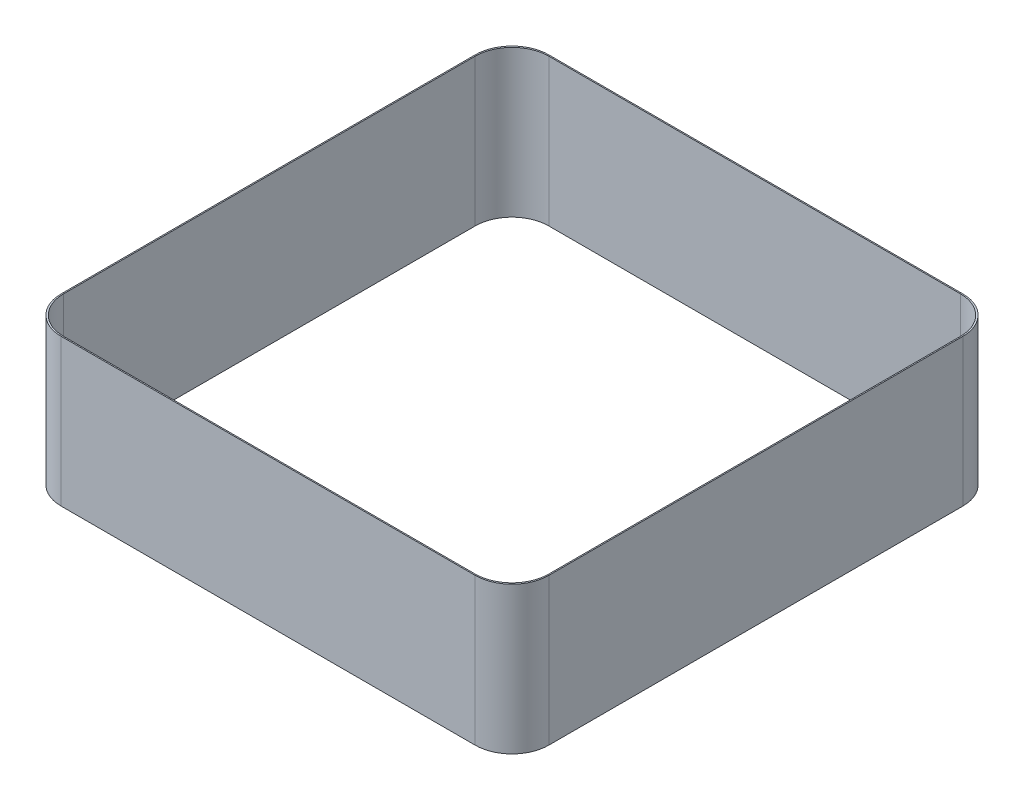
ISO-10303-21;
HEADER;
FILE_DESCRIPTION(('STEP AP214'),'2;1');
FILE_NAME('part.step','',(''),(''),'','','');
FILE_SCHEMA(('AUTOMOTIVE_DESIGN { 1 0 10303 214 1 1 1 1 }'));
ENDSEC;
DATA;
#1=APPLICATION_CONTEXT('core data for automotive mechanical design processes');
#2=APPLICATION_PROTOCOL_DEFINITION('international standard','automotive_design',2000,#1);
#3=PRODUCT_CONTEXT('',#1,'mechanical');
#4=PRODUCT('Part','Part','',(#3));
#5=PRODUCT_RELATED_PRODUCT_CATEGORY('part','',(#4));
#6=PRODUCT_DEFINITION_FORMATION('','',#4);
#7=PRODUCT_DEFINITION_CONTEXT('part definition',#1,'design');
#8=PRODUCT_DEFINITION('design','',#6,#7);
#9=PRODUCT_DEFINITION_SHAPE('','',#8);
#10=(LENGTH_UNIT() NAMED_UNIT(*) SI_UNIT(.MILLI.,.METRE.));
#11=(NAMED_UNIT(*) PLANE_ANGLE_UNIT() SI_UNIT($,.RADIAN.));
#12=(NAMED_UNIT(*) SI_UNIT($,.STERADIAN.) SOLID_ANGLE_UNIT());
#13=UNCERTAINTY_MEASURE_WITH_UNIT(LENGTH_MEASURE(1.E-05),#10,'distance_accuracy_value','');
#14=(GEOMETRIC_REPRESENTATION_CONTEXT(3) GLOBAL_UNCERTAINTY_ASSIGNED_CONTEXT((#13)) GLOBAL_UNIT_ASSIGNED_CONTEXT((#10,
#11,#12)) REPRESENTATION_CONTEXT('',''));
#15=CARTESIAN_POINT('',(0.,0.,0.));
#16=DIRECTION('',(0.,0.,1.));
#17=DIRECTION('',(1.,0.,0.));
#18=AXIS2_PLACEMENT_3D('',#15,#16,#17);
#19=CARTESIAN_POINT('',(-8.9408,6.35,8.9408));
#20=DIRECTION('',(0.,-1.,0.));
#21=DIRECTION('',(0.,0.,-1.));
#22=AXIS2_PLACEMENT_3D('',#19,#20,#21);
#23=PLANE('',#22);
#24=CARTESIAN_POINT('',(-8.9408,6.35,8.9408));
#25=DIRECTION('',(0.,1.,0.));
#26=DIRECTION('',(0.,0.,-1.));
#27=AXIS2_PLACEMENT_3D('',#24,#25,#26);
#28=CIRCLE('',#27,1.5875);
#29=CARTESIAN_POINT('',(-10.5283,6.35,8.9408));
#30=VERTEX_POINT('',#29);
#31=CARTESIAN_POINT('',(-8.9408,6.35,10.5283));
#32=VERTEX_POINT('',#31);
#33=EDGE_CURVE('E215',#30,#32,#28,.T.);
#34=ORIENTED_EDGE('',*,*,#33,.T.);
#35=DIRECTION('',(1.,0.,0.));
#36=VECTOR('',#35,1.);
#37=CARTESIAN_POINT('',(-8.9408,6.35,10.5283));
#38=LINE('',#37,#36);
#39=CARTESIAN_POINT('',(8.9408,6.35,10.5283));
#40=VERTEX_POINT('',#39);
#41=EDGE_CURVE('E218',#32,#40,#38,.T.);
#42=ORIENTED_EDGE('',*,*,#41,.T.);
#43=CARTESIAN_POINT('',(8.9408,6.35,8.9408));
#44=DIRECTION('',(0.,1.,0.));
#45=DIRECTION('',(0.,0.,1.));
#46=AXIS2_PLACEMENT_3D('',#43,#44,#45);
#47=CIRCLE('',#46,1.5875);
#48=CARTESIAN_POINT('',(10.5283,6.35,8.9408));
#49=VERTEX_POINT('',#48);
#50=EDGE_CURVE('E221',#40,#49,#47,.T.);
#51=ORIENTED_EDGE('',*,*,#50,.T.);
#52=DIRECTION('',(0.,0.,-1.));
#53=VECTOR('',#52,1.);
#54=CARTESIAN_POINT('',(10.5283,6.35,8.9408));
#55=LINE('',#54,#53);
#56=CARTESIAN_POINT('',(10.5283,6.35,-8.9408));
#57=VERTEX_POINT('',#56);
#58=EDGE_CURVE('E223',#49,#57,#55,.T.);
#59=ORIENTED_EDGE('',*,*,#58,.T.);
#60=CARTESIAN_POINT('',(8.9408,6.35,-8.9408));
#61=DIRECTION('',(0.,1.,0.));
#62=DIRECTION('',(0.,0.,-1.));
#63=AXIS2_PLACEMENT_3D('',#60,#61,#62);
#64=CIRCLE('',#63,1.5875);
#65=CARTESIAN_POINT('',(8.9408,6.35,-10.5283));
#66=VERTEX_POINT('',#65);
#67=EDGE_CURVE('E225',#57,#66,#64,.T.);
#68=ORIENTED_EDGE('',*,*,#67,.T.);
#69=DIRECTION('',(-1.,0.,0.));
#70=VECTOR('',#69,1.);
#71=CARTESIAN_POINT('',(-8.9408,6.35,-10.5283));
#72=LINE('',#71,#70);
#73=CARTESIAN_POINT('',(-8.9408,6.35,-10.5283));
#74=VERTEX_POINT('',#73);
#75=EDGE_CURVE('E227',#66,#74,#72,.T.);
#76=ORIENTED_EDGE('',*,*,#75,.T.);
#77=CARTESIAN_POINT('',(-8.9408,6.35,-8.9408));
#78=DIRECTION('',(0.,1.,0.));
#79=DIRECTION('',(0.,0.,-1.));
#80=AXIS2_PLACEMENT_3D('',#77,#78,#79);
#81=CIRCLE('',#80,1.5875);
#82=CARTESIAN_POINT('',(-10.5283,6.35,-8.9408));
#83=VERTEX_POINT('',#82);
#84=EDGE_CURVE('E229',#74,#83,#81,.T.);
#85=ORIENTED_EDGE('',*,*,#84,.T.);
#86=DIRECTION('',(0.,0.,1.));
#87=VECTOR('',#86,1.);
#88=CARTESIAN_POINT('',(-10.5283,6.35,8.9408));
#89=LINE('',#88,#87);
#90=EDGE_CURVE('E231',#83,#30,#89,.T.);
#91=ORIENTED_EDGE('',*,*,#90,.T.);
#92=EDGE_LOOP('',(#34,#42,#51,#59,#68,#76,#85,#91));
#93=FACE_BOUND('',#92,.T.);
#94=CARTESIAN_POINT('',(-8.89,6.35,-8.89));
#95=DIRECTION('',(0.,1.,0.));
#96=DIRECTION('',(0.,0.,-1.));
#97=AXIS2_PLACEMENT_3D('',#94,#95,#96);
#98=CIRCLE('',#97,1.5875);
#99=CARTESIAN_POINT('',(-8.89,6.35,-10.4775));
#100=VERTEX_POINT('',#99);
#101=CARTESIAN_POINT('',(-10.4775,6.35,-8.89));
#102=VERTEX_POINT('',#101);
#103=EDGE_CURVE('E150',#100,#102,#98,.T.);
#104=ORIENTED_EDGE('',*,*,#103,.F.);
#105=DIRECTION('',(-1.,0.,0.));
#106=VECTOR('',#105,1.);
#107=CARTESIAN_POINT('',(-8.89,6.35,-10.4775));
#108=LINE('',#107,#106);
#109=CARTESIAN_POINT('',(8.89,6.35,-10.4775));
#110=VERTEX_POINT('',#109);
#111=EDGE_CURVE('E183',#110,#100,#108,.T.);
#112=ORIENTED_EDGE('',*,*,#111,.F.);
#113=CARTESIAN_POINT('',(8.89,6.35,-8.89));
#114=DIRECTION('',(0.,1.,0.));
#115=DIRECTION('',(0.,0.,-1.));
#116=AXIS2_PLACEMENT_3D('',#113,#114,#115);
#117=CIRCLE('',#116,1.5875);
#118=CARTESIAN_POINT('',(10.4775,6.35,-8.89));
#119=VERTEX_POINT('',#118);
#120=EDGE_CURVE('E181',#119,#110,#117,.T.);
#121=ORIENTED_EDGE('',*,*,#120,.F.);
#122=DIRECTION('',(0.,0.,-1.));
#123=VECTOR('',#122,1.);
#124=CARTESIAN_POINT('',(10.4775,6.35,8.89));
#125=LINE('',#124,#123);
#126=CARTESIAN_POINT('',(10.4775,6.35,8.89));
#127=VERTEX_POINT('',#126);
#128=EDGE_CURVE('E179',#127,#119,#125,.T.);
#129=ORIENTED_EDGE('',*,*,#128,.F.);
#130=CARTESIAN_POINT('',(8.89,6.35,8.89));
#131=DIRECTION('',(0.,1.,0.));
#132=DIRECTION('',(0.,0.,1.));
#133=AXIS2_PLACEMENT_3D('',#130,#131,#132);
#134=CIRCLE('',#133,1.5875);
#135=CARTESIAN_POINT('',(8.89,6.35,10.4775));
#136=VERTEX_POINT('',#135);
#137=EDGE_CURVE('E177',#136,#127,#134,.T.);
#138=ORIENTED_EDGE('',*,*,#137,.F.);
#139=DIRECTION('',(1.,0.,0.));
#140=VECTOR('',#139,1.);
#141=CARTESIAN_POINT('',(-8.89,6.35,10.4775));
#142=LINE('',#141,#140);
#143=CARTESIAN_POINT('',(-8.89,6.35,10.4775));
#144=VERTEX_POINT('',#143);
#145=EDGE_CURVE('E173',#144,#136,#142,.T.);
#146=ORIENTED_EDGE('',*,*,#145,.F.);
#147=CARTESIAN_POINT('',(-8.89,6.35,8.89));
#148=DIRECTION('',(0.,1.,0.));
#149=DIRECTION('',(0.,0.,-1.));
#150=AXIS2_PLACEMENT_3D('',#147,#148,#149);
#151=CIRCLE('',#150,1.5875);
#152=CARTESIAN_POINT('',(-10.4775,6.35,8.89));
#153=VERTEX_POINT('',#152);
#154=EDGE_CURVE('E171',#153,#144,#151,.T.);
#155=ORIENTED_EDGE('',*,*,#154,.F.);
#156=DIRECTION('',(0.,0.,1.));
#157=VECTOR('',#156,1.);
#158=CARTESIAN_POINT('',(-10.4775,6.35,8.89));
#159=LINE('',#158,#157);
#160=EDGE_CURVE('E158',#102,#153,#159,.T.);
#161=ORIENTED_EDGE('',*,*,#160,.F.);
#162=EDGE_LOOP('',(#104,#112,#121,#129,#138,#146,#155,#161));
#163=FACE_BOUND('',#162,.T.);
#164=ADVANCED_FACE('F37',(#93,#163),#23,.F.);
#165=CARTESIAN_POINT('',(-8.9408,0.,8.9408));
#166=DIRECTION('',(0.,-1.,0.));
#167=DIRECTION('',(0.,0.,-1.));
#168=AXIS2_PLACEMENT_3D('',#165,#166,#167);
#169=PLANE('',#168);
#170=CARTESIAN_POINT('',(-8.9408,0.,8.9408));
#171=DIRECTION('',(0.,1.,0.));
#172=DIRECTION('',(0.,0.,-1.));
#173=AXIS2_PLACEMENT_3D('',#170,#171,#172);
#174=CIRCLE('',#173,1.5875);
#175=CARTESIAN_POINT('',(-10.5283,0.,8.9408));
#176=VERTEX_POINT('',#175);
#177=CARTESIAN_POINT('',(-8.9408,0.,10.5283));
#178=VERTEX_POINT('',#177);
#179=EDGE_CURVE('E166',#176,#178,#174,.T.);
#180=ORIENTED_EDGE('',*,*,#179,.F.);
#181=DIRECTION('',(0.,0.,1.));
#182=VECTOR('',#181,1.);
#183=CARTESIAN_POINT('',(-10.5283,0.,8.9408));
#184=LINE('',#183,#182);
#185=CARTESIAN_POINT('',(-10.5283,0.,-8.9408));
#186=VERTEX_POINT('',#185);
#187=EDGE_CURVE('E219',#186,#176,#184,.T.);
#188=ORIENTED_EDGE('',*,*,#187,.F.);
#189=CARTESIAN_POINT('',(-8.9408,0.,-8.9408));
#190=DIRECTION('',(0.,1.,0.));
#191=DIRECTION('',(0.,0.,-1.));
#192=AXIS2_PLACEMENT_3D('',#189,#190,#191);
#193=CIRCLE('',#192,1.5875);
#194=CARTESIAN_POINT('',(-8.9408,0.,-10.5283));
#195=VERTEX_POINT('',#194);
#196=EDGE_CURVE('E246',#195,#186,#193,.T.);
#197=ORIENTED_EDGE('',*,*,#196,.F.);
#198=DIRECTION('',(-1.,0.,0.));
#199=VECTOR('',#198,1.);
#200=CARTESIAN_POINT('',(-8.9408,0.,-10.5283));
#201=LINE('',#200,#199);
#202=CARTESIAN_POINT('',(8.9408,0.,-10.5283));
#203=VERTEX_POINT('',#202);
#204=EDGE_CURVE('E244',#203,#195,#201,.T.);
#205=ORIENTED_EDGE('',*,*,#204,.F.);
#206=CARTESIAN_POINT('',(8.9408,0.,-8.9408));
#207=DIRECTION('',(0.,1.,0.));
#208=DIRECTION('',(0.,0.,-1.));
#209=AXIS2_PLACEMENT_3D('',#206,#207,#208);
#210=CIRCLE('',#209,1.5875);
#211=CARTESIAN_POINT('',(10.5283,0.,-8.9408));
#212=VERTEX_POINT('',#211);
#213=EDGE_CURVE('E242',#212,#203,#210,.T.);
#214=ORIENTED_EDGE('',*,*,#213,.F.);
#215=DIRECTION('',(0.,0.,-1.));
#216=VECTOR('',#215,1.);
#217=CARTESIAN_POINT('',(10.5283,0.,8.9408));
#218=LINE('',#217,#216);
#219=CARTESIAN_POINT('',(10.5283,0.,8.9408));
#220=VERTEX_POINT('',#219);
#221=EDGE_CURVE('E240',#220,#212,#218,.T.);
#222=ORIENTED_EDGE('',*,*,#221,.F.);
#223=CARTESIAN_POINT('',(8.9408,0.,8.9408));
#224=DIRECTION('',(0.,1.,0.));
#225=DIRECTION('',(0.,0.,1.));
#226=AXIS2_PLACEMENT_3D('',#223,#224,#225);
#227=CIRCLE('',#226,1.5875);
#228=CARTESIAN_POINT('',(8.9408,0.,10.5283));
#229=VERTEX_POINT('',#228);
#230=EDGE_CURVE('E238',#229,#220,#227,.T.);
#231=ORIENTED_EDGE('',*,*,#230,.F.);
#232=DIRECTION('',(1.,0.,0.));
#233=VECTOR('',#232,1.);
#234=CARTESIAN_POINT('',(-8.9408,0.,10.5283));
#235=LINE('',#234,#233);
#236=EDGE_CURVE('E236',#178,#229,#235,.T.);
#237=ORIENTED_EDGE('',*,*,#236,.F.);
#238=EDGE_LOOP('',(#180,#188,#197,#205,#214,#222,#231,#237));
#239=FACE_BOUND('',#238,.T.);
#240=DIRECTION('',(-1.,0.,0.));
#241=VECTOR('',#240,1.);
#242=CARTESIAN_POINT('',(-8.89,0.,-10.4775));
#243=LINE('',#242,#241);
#244=CARTESIAN_POINT('',(8.89,0.,-10.4775));
#245=VERTEX_POINT('',#244);
#246=CARTESIAN_POINT('',(-8.89,0.,-10.4775));
#247=VERTEX_POINT('',#246);
#248=EDGE_CURVE('E159',#245,#247,#243,.T.);
#249=ORIENTED_EDGE('',*,*,#248,.T.);
#250=CARTESIAN_POINT('',(-8.89,0.,-8.89));
#251=DIRECTION('',(0.,1.,0.));
#252=DIRECTION('',(0.,0.,-1.));
#253=AXIS2_PLACEMENT_3D('',#250,#251,#252);
#254=CIRCLE('',#253,1.5875);
#255=CARTESIAN_POINT('',(-10.4775,0.,-8.89));
#256=VERTEX_POINT('',#255);
#257=EDGE_CURVE('E60',#247,#256,#254,.T.);
#258=ORIENTED_EDGE('',*,*,#257,.T.);
#259=DIRECTION('',(0.,0.,1.));
#260=VECTOR('',#259,1.);
#261=CARTESIAN_POINT('',(-10.4775,0.,8.89));
#262=LINE('',#261,#260);
#263=CARTESIAN_POINT('',(-10.4775,0.,8.89));
#264=VERTEX_POINT('',#263);
#265=EDGE_CURVE('E165',#256,#264,#262,.T.);
#266=ORIENTED_EDGE('',*,*,#265,.T.);
#267=CARTESIAN_POINT('',(-8.89,0.,8.89));
#268=DIRECTION('',(0.,1.,0.));
#269=DIRECTION('',(0.,0.,-1.));
#270=AXIS2_PLACEMENT_3D('',#267,#268,#269);
#271=CIRCLE('',#270,1.5875);
#272=CARTESIAN_POINT('',(-8.89,0.,10.4775));
#273=VERTEX_POINT('',#272);
#274=EDGE_CURVE('E187',#264,#273,#271,.T.);
#275=ORIENTED_EDGE('',*,*,#274,.T.);
#276=DIRECTION('',(1.,0.,0.));
#277=VECTOR('',#276,1.);
#278=CARTESIAN_POINT('',(-8.89,0.,10.4775));
#279=LINE('',#278,#277);
#280=CARTESIAN_POINT('',(8.89,0.,10.4775));
#281=VERTEX_POINT('',#280);
#282=EDGE_CURVE('E190',#273,#281,#279,.T.);
#283=ORIENTED_EDGE('',*,*,#282,.T.);
#284=CARTESIAN_POINT('',(8.89,0.,8.89));
#285=DIRECTION('',(0.,1.,0.));
#286=DIRECTION('',(0.,0.,1.));
#287=AXIS2_PLACEMENT_3D('',#284,#285,#286);
#288=CIRCLE('',#287,1.5875);
#289=CARTESIAN_POINT('',(10.4775,0.,8.89));
#290=VERTEX_POINT('',#289);
#291=EDGE_CURVE('E193',#281,#290,#288,.T.);
#292=ORIENTED_EDGE('',*,*,#291,.T.);
#293=DIRECTION('',(0.,0.,-1.));
#294=VECTOR('',#293,1.);
#295=CARTESIAN_POINT('',(10.4775,0.,8.89));
#296=LINE('',#295,#294);
#297=CARTESIAN_POINT('',(10.4775,0.,-8.89));
#298=VERTEX_POINT('',#297);
#299=EDGE_CURVE('E196',#290,#298,#296,.T.);
#300=ORIENTED_EDGE('',*,*,#299,.T.);
#301=CARTESIAN_POINT('',(8.89,0.,-8.89));
#302=DIRECTION('',(0.,1.,0.));
#303=DIRECTION('',(0.,0.,-1.));
#304=AXIS2_PLACEMENT_3D('',#301,#302,#303);
#305=CIRCLE('',#304,1.5875);
#306=EDGE_CURVE('E199',#298,#245,#305,.T.);
#307=ORIENTED_EDGE('',*,*,#306,.T.);
#308=EDGE_LOOP('',(#249,#258,#266,#275,#283,#292,#300,#307));
#309=FACE_BOUND('',#308,.T.);
#310=ADVANCED_FACE('F276',(#239,#309),#169,.T.);
#311=CARTESIAN_POINT('',(-8.9408,6.35,8.9408));
#312=DIRECTION('',(0.,-1.,0.));
#313=DIRECTION('',(0.,0.,-1.));
#314=AXIS2_PLACEMENT_3D('',#311,#312,#313);
#315=CYLINDRICAL_SURFACE('',#314,1.5875);
#316=ORIENTED_EDGE('',*,*,#179,.T.);
#317=DIRECTION('',(0.,-1.,0.));
#318=VECTOR('',#317,1.);
#319=CARTESIAN_POINT('',(-8.9408,6.35,10.5283));
#320=LINE('',#319,#318);
#321=EDGE_CURVE('E11',#32,#178,#320,.T.);
#322=ORIENTED_EDGE('',*,*,#321,.F.);
#323=ORIENTED_EDGE('',*,*,#33,.F.);
#324=DIRECTION('',(0.,-1.,0.));
#325=VECTOR('',#324,1.);
#326=CARTESIAN_POINT('',(-10.5283,6.35,8.9408));
#327=LINE('',#326,#325);
#328=EDGE_CURVE('E233',#30,#176,#327,.T.);
#329=ORIENTED_EDGE('',*,*,#328,.T.);
#330=EDGE_LOOP('',(#316,#322,#323,#329));
#331=FACE_BOUND('',#330,.T.);
#332=ADVANCED_FACE('F39',(#331),#315,.T.);
#333=CARTESIAN_POINT('',(-8.9408,6.35,10.5283));
#334=DIRECTION('',(0.,0.,-1.));
#335=DIRECTION('',(-1.,0.,0.));
#336=AXIS2_PLACEMENT_3D('',#333,#334,#335);
#337=PLANE('',#336);
#338=ORIENTED_EDGE('',*,*,#236,.T.);
#339=DIRECTION('',(0.,-1.,0.));
#340=VECTOR('',#339,1.);
#341=CARTESIAN_POINT('',(8.9408,6.35,10.5283));
#342=LINE('',#341,#340);
#343=EDGE_CURVE('E45',#40,#229,#342,.T.);
#344=ORIENTED_EDGE('',*,*,#343,.F.);
#345=ORIENTED_EDGE('',*,*,#41,.F.);
#346=ORIENTED_EDGE('',*,*,#321,.T.);
#347=EDGE_LOOP('',(#338,#344,#345,#346));
#348=FACE_BOUND('',#347,.T.);
#349=ADVANCED_FACE('F293',(#348),#337,.F.);
#350=CARTESIAN_POINT('',(8.9408,6.35,8.9408));
#351=DIRECTION('',(0.,-1.,0.));
#352=DIRECTION('',(0.,0.,-1.));
#353=AXIS2_PLACEMENT_3D('',#350,#351,#352);
#354=CYLINDRICAL_SURFACE('',#353,1.5875);
#355=ORIENTED_EDGE('',*,*,#230,.T.);
#356=DIRECTION('',(0.,-1.,0.));
#357=VECTOR('',#356,1.);
#358=CARTESIAN_POINT('',(10.5283,6.35,8.9408));
#359=LINE('',#358,#357);
#360=EDGE_CURVE('E263',#49,#220,#359,.T.);
#361=ORIENTED_EDGE('',*,*,#360,.F.);
#362=ORIENTED_EDGE('',*,*,#50,.F.);
#363=ORIENTED_EDGE('',*,*,#343,.T.);
#364=EDGE_LOOP('',(#355,#361,#362,#363));
#365=FACE_BOUND('',#364,.T.);
#366=ADVANCED_FACE('F270',(#365),#354,.T.);
#367=CARTESIAN_POINT('',(10.5283,6.35,8.9408));
#368=DIRECTION('',(-1.,0.,0.));
#369=DIRECTION('',(0.,0.,1.));
#370=AXIS2_PLACEMENT_3D('',#367,#368,#369);
#371=PLANE('',#370);
#372=ORIENTED_EDGE('',*,*,#221,.T.);
#373=DIRECTION('',(0.,-1.,0.));
#374=VECTOR('',#373,1.);
#375=CARTESIAN_POINT('',(10.5283,6.35,-8.9408));
#376=LINE('',#375,#374);
#377=EDGE_CURVE('E260',#57,#212,#376,.T.);
#378=ORIENTED_EDGE('',*,*,#377,.F.);
#379=ORIENTED_EDGE('',*,*,#58,.F.);
#380=ORIENTED_EDGE('',*,*,#360,.T.);
#381=EDGE_LOOP('',(#372,#378,#379,#380));
#382=FACE_BOUND('',#381,.T.);
#383=ADVANCED_FACE('F282',(#382),#371,.F.);
#384=CARTESIAN_POINT('',(8.9408,6.35,-8.9408));
#385=DIRECTION('',(0.,-1.,0.));
#386=DIRECTION('',(0.,0.,-1.));
#387=AXIS2_PLACEMENT_3D('',#384,#385,#386);
#388=CYLINDRICAL_SURFACE('',#387,1.5875);
#389=ORIENTED_EDGE('',*,*,#213,.T.);
#390=DIRECTION('',(0.,-1.,0.));
#391=VECTOR('',#390,1.);
#392=CARTESIAN_POINT('',(8.9408,6.35,-10.5283));
#393=LINE('',#392,#391);
#394=EDGE_CURVE('E257',#66,#203,#393,.T.);
#395=ORIENTED_EDGE('',*,*,#394,.F.);
#396=ORIENTED_EDGE('',*,*,#67,.F.);
#397=ORIENTED_EDGE('',*,*,#377,.T.);
#398=EDGE_LOOP('',(#389,#395,#396,#397));
#399=FACE_BOUND('',#398,.T.);
#400=ADVANCED_FACE('F286',(#399),#388,.T.);
#401=CARTESIAN_POINT('',(-8.9408,6.35,-10.5283));
#402=DIRECTION('',(0.,0.,1.));
#403=DIRECTION('',(1.,0.,0.));
#404=AXIS2_PLACEMENT_3D('',#401,#402,#403);
#405=PLANE('',#404);
#406=ORIENTED_EDGE('',*,*,#204,.T.);
#407=DIRECTION('',(0.,-1.,0.));
#408=VECTOR('',#407,1.);
#409=CARTESIAN_POINT('',(-8.9408,6.35,-10.5283));
#410=LINE('',#409,#408);
#411=EDGE_CURVE('E254',#74,#195,#410,.T.);
#412=ORIENTED_EDGE('',*,*,#411,.F.);
#413=ORIENTED_EDGE('',*,*,#75,.F.);
#414=ORIENTED_EDGE('',*,*,#394,.T.);
#415=EDGE_LOOP('',(#406,#412,#413,#414));
#416=FACE_BOUND('',#415,.T.);
#417=ADVANCED_FACE('F306',(#416),#405,.F.);
#418=CARTESIAN_POINT('',(-8.9408,6.35,-8.9408));
#419=DIRECTION('',(0.,-1.,0.));
#420=DIRECTION('',(0.,0.,-1.));
#421=AXIS2_PLACEMENT_3D('',#418,#419,#420);
#422=CYLINDRICAL_SURFACE('',#421,1.5875);
#423=ORIENTED_EDGE('',*,*,#196,.T.);
#424=DIRECTION('',(0.,-1.,0.));
#425=VECTOR('',#424,1.);
#426=CARTESIAN_POINT('',(-10.5283,6.35,-8.9408));
#427=LINE('',#426,#425);
#428=EDGE_CURVE('E251',#83,#186,#427,.T.);
#429=ORIENTED_EDGE('',*,*,#428,.F.);
#430=ORIENTED_EDGE('',*,*,#84,.F.);
#431=ORIENTED_EDGE('',*,*,#411,.T.);
#432=EDGE_LOOP('',(#423,#429,#430,#431));
#433=FACE_BOUND('',#432,.T.);
#434=ADVANCED_FACE('F304',(#433),#422,.T.);
#435=CARTESIAN_POINT('',(-10.5283,6.35,8.9408));
#436=DIRECTION('',(1.,0.,0.));
#437=DIRECTION('',(0.,0.,-1.));
#438=AXIS2_PLACEMENT_3D('',#435,#436,#437);
#439=PLANE('',#438);
#440=ORIENTED_EDGE('',*,*,#187,.T.);
#441=ORIENTED_EDGE('',*,*,#328,.F.);
#442=ORIENTED_EDGE('',*,*,#90,.F.);
#443=ORIENTED_EDGE('',*,*,#428,.T.);
#444=EDGE_LOOP('',(#440,#441,#442,#443));
#445=FACE_BOUND('',#444,.T.);
#446=ADVANCED_FACE('F299',(#445),#439,.F.);
#447=CARTESIAN_POINT('',(-8.89,6.35,-8.89));
#448=DIRECTION('',(0.,-1.,0.));
#449=DIRECTION('',(0.,0.,-1.));
#450=AXIS2_PLACEMENT_3D('',#447,#448,#449);
#451=CYLINDRICAL_SURFACE('',#450,1.5875);
#452=ORIENTED_EDGE('',*,*,#257,.F.);
#453=DIRECTION('',(0.,-1.,0.));
#454=VECTOR('',#453,1.);
#455=CARTESIAN_POINT('',(-8.89,6.35,-10.4775));
#456=LINE('',#455,#454);
#457=EDGE_CURVE('E154',#100,#247,#456,.T.);
#458=ORIENTED_EDGE('',*,*,#457,.F.);
#459=ORIENTED_EDGE('',*,*,#103,.T.);
#460=DIRECTION('',(0.,-1.,0.));
#461=VECTOR('',#460,1.);
#462=CARTESIAN_POINT('',(-10.4775,6.35,-8.89));
#463=LINE('',#462,#461);
#464=EDGE_CURVE('E153',#102,#256,#463,.T.);
#465=ORIENTED_EDGE('',*,*,#464,.T.);
#466=EDGE_LOOP('',(#452,#458,#459,#465));
#467=FACE_BOUND('',#466,.T.);
#468=ADVANCED_FACE('F152',(#467),#451,.F.);
#469=CARTESIAN_POINT('',(-10.4775,6.35,8.89));
#470=DIRECTION('',(1.,0.,0.));
#471=DIRECTION('',(0.,0.,-1.));
#472=AXIS2_PLACEMENT_3D('',#469,#470,#471);
#473=PLANE('',#472);
#474=ORIENTED_EDGE('',*,*,#265,.F.);
#475=ORIENTED_EDGE('',*,*,#464,.F.);
#476=ORIENTED_EDGE('',*,*,#160,.T.);
#477=DIRECTION('',(0.,-1.,0.));
#478=VECTOR('',#477,1.);
#479=CARTESIAN_POINT('',(-10.4775,6.35,8.89));
#480=LINE('',#479,#478);
#481=EDGE_CURVE('E167',#153,#264,#480,.T.);
#482=ORIENTED_EDGE('',*,*,#481,.T.);
#483=EDGE_LOOP('',(#474,#475,#476,#482));
#484=FACE_BOUND('',#483,.T.);
#485=ADVANCED_FACE('F162',(#484),#473,.T.);
#486=CARTESIAN_POINT('',(-8.89,6.35,8.89));
#487=DIRECTION('',(0.,-1.,0.));
#488=DIRECTION('',(0.,0.,-1.));
#489=AXIS2_PLACEMENT_3D('',#486,#487,#488);
#490=CYLINDRICAL_SURFACE('',#489,1.5875);
#491=ORIENTED_EDGE('',*,*,#274,.F.);
#492=ORIENTED_EDGE('',*,*,#481,.F.);
#493=ORIENTED_EDGE('',*,*,#154,.T.);
#494=DIRECTION('',(0.,-1.,0.));
#495=VECTOR('',#494,1.);
#496=CARTESIAN_POINT('',(-8.89,6.35,10.4775));
#497=LINE('',#496,#495);
#498=EDGE_CURVE('E212',#144,#273,#497,.T.);
#499=ORIENTED_EDGE('',*,*,#498,.T.);
#500=EDGE_LOOP('',(#491,#492,#493,#499));
#501=FACE_BOUND('',#500,.T.);
#502=ADVANCED_FACE('F331',(#501),#490,.F.);
#503=CARTESIAN_POINT('',(-8.89,6.35,10.4775));
#504=DIRECTION('',(0.,0.,-1.));
#505=DIRECTION('',(-1.,0.,0.));
#506=AXIS2_PLACEMENT_3D('',#503,#504,#505);
#507=PLANE('',#506);
#508=ORIENTED_EDGE('',*,*,#282,.F.);
#509=ORIENTED_EDGE('',*,*,#498,.F.);
#510=ORIENTED_EDGE('',*,*,#145,.T.);
#511=DIRECTION('',(0.,-1.,0.));
#512=VECTOR('',#511,1.);
#513=CARTESIAN_POINT('',(8.89,6.35,10.4775));
#514=LINE('',#513,#512);
#515=EDGE_CURVE('E210',#136,#281,#514,.T.);
#516=ORIENTED_EDGE('',*,*,#515,.T.);
#517=EDGE_LOOP('',(#508,#509,#510,#516));
#518=FACE_BOUND('',#517,.T.);
#519=ADVANCED_FACE('F335',(#518),#507,.T.);
#520=CARTESIAN_POINT('',(8.89,6.35,8.89));
#521=DIRECTION('',(0.,-1.,0.));
#522=DIRECTION('',(0.,0.,-1.));
#523=AXIS2_PLACEMENT_3D('',#520,#521,#522);
#524=CYLINDRICAL_SURFACE('',#523,1.5875);
#525=ORIENTED_EDGE('',*,*,#291,.F.);
#526=ORIENTED_EDGE('',*,*,#515,.F.);
#527=ORIENTED_EDGE('',*,*,#137,.T.);
#528=DIRECTION('',(0.,-1.,0.));
#529=VECTOR('',#528,1.);
#530=CARTESIAN_POINT('',(10.4775,6.35,8.89));
#531=LINE('',#530,#529);
#532=EDGE_CURVE('E208',#127,#290,#531,.T.);
#533=ORIENTED_EDGE('',*,*,#532,.T.);
#534=EDGE_LOOP('',(#525,#526,#527,#533));
#535=FACE_BOUND('',#534,.T.);
#536=ADVANCED_FACE('F341',(#535),#524,.F.);
#537=CARTESIAN_POINT('',(10.4775,6.35,8.89));
#538=DIRECTION('',(-1.,0.,0.));
#539=DIRECTION('',(0.,0.,1.));
#540=AXIS2_PLACEMENT_3D('',#537,#538,#539);
#541=PLANE('',#540);
#542=ORIENTED_EDGE('',*,*,#299,.F.);
#543=ORIENTED_EDGE('',*,*,#532,.F.);
#544=ORIENTED_EDGE('',*,*,#128,.T.);
#545=DIRECTION('',(0.,-1.,0.));
#546=VECTOR('',#545,1.);
#547=CARTESIAN_POINT('',(10.4775,6.35,-8.89));
#548=LINE('',#547,#546);
#549=EDGE_CURVE('E206',#119,#298,#548,.T.);
#550=ORIENTED_EDGE('',*,*,#549,.T.);
#551=EDGE_LOOP('',(#542,#543,#544,#550));
#552=FACE_BOUND('',#551,.T.);
#553=ADVANCED_FACE('F345',(#552),#541,.T.);
#554=CARTESIAN_POINT('',(8.89,6.35,-8.89));
#555=DIRECTION('',(0.,-1.,0.));
#556=DIRECTION('',(0.,0.,-1.));
#557=AXIS2_PLACEMENT_3D('',#554,#555,#556);
#558=CYLINDRICAL_SURFACE('',#557,1.5875);
#559=ORIENTED_EDGE('',*,*,#306,.F.);
#560=ORIENTED_EDGE('',*,*,#549,.F.);
#561=ORIENTED_EDGE('',*,*,#120,.T.);
#562=DIRECTION('',(0.,-1.,0.));
#563=VECTOR('',#562,1.);
#564=CARTESIAN_POINT('',(8.89,6.35,-10.4775));
#565=LINE('',#564,#563);
#566=EDGE_CURVE('E52',#110,#245,#565,.T.);
#567=ORIENTED_EDGE('',*,*,#566,.T.);
#568=EDGE_LOOP('',(#559,#560,#561,#567));
#569=FACE_BOUND('',#568,.T.);
#570=ADVANCED_FACE('F349',(#569),#558,.F.);
#571=CARTESIAN_POINT('',(-8.89,6.35,-10.4775));
#572=DIRECTION('',(0.,0.,1.));
#573=DIRECTION('',(1.,0.,0.));
#574=AXIS2_PLACEMENT_3D('',#571,#572,#573);
#575=PLANE('',#574);
#576=ORIENTED_EDGE('',*,*,#248,.F.);
#577=ORIENTED_EDGE('',*,*,#566,.F.);
#578=ORIENTED_EDGE('',*,*,#111,.T.);
#579=ORIENTED_EDGE('',*,*,#457,.T.);
#580=EDGE_LOOP('',(#576,#577,#578,#579));
#581=FACE_BOUND('',#580,.T.);
#582=ADVANCED_FACE('F353',(#581),#575,.T.);
#583=CLOSED_SHELL('',(#164,#310,#332,#349,#366,#383,#400,#417,#434,#446,#468,#485,#502,#519,
#536,#553,#570,#582));
#584=MANIFOLD_SOLID_BREP('B2',#583);
#585=ADVANCED_BREP_SHAPE_REPRESENTATION('',(#18,#584),#14);
#586=SHAPE_DEFINITION_REPRESENTATION(#9,#585);
ENDSEC;
END-ISO-10303-21;
